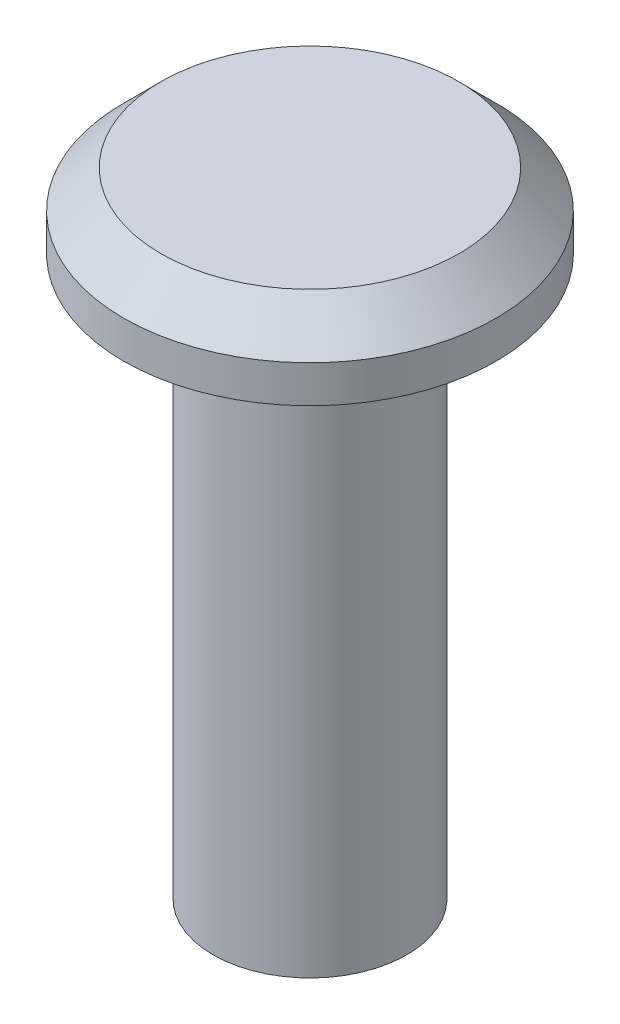
ISO-10303-21;
HEADER;
FILE_DESCRIPTION(('STEP AP214'),'2;1');
FILE_NAME('part.step','',(''),(''),'','','');
FILE_SCHEMA(('AUTOMOTIVE_DESIGN { 1 0 10303 214 1 1 1 1 }'));
ENDSEC;
DATA;
#1=APPLICATION_CONTEXT('core data for automotive mechanical design processes');
#2=APPLICATION_PROTOCOL_DEFINITION('international standard','automotive_design',2000,#1);
#3=PRODUCT_CONTEXT('',#1,'mechanical');
#4=PRODUCT('Part','Part','',(#3));
#5=PRODUCT_RELATED_PRODUCT_CATEGORY('part','',(#4));
#6=PRODUCT_DEFINITION_FORMATION('','',#4);
#7=PRODUCT_DEFINITION_CONTEXT('part definition',#1,'design');
#8=PRODUCT_DEFINITION('design','',#6,#7);
#9=PRODUCT_DEFINITION_SHAPE('','',#8);
#10=(LENGTH_UNIT() NAMED_UNIT(*) SI_UNIT(.MILLI.,.METRE.));
#11=(NAMED_UNIT(*) PLANE_ANGLE_UNIT() SI_UNIT($,.RADIAN.));
#12=(NAMED_UNIT(*) SI_UNIT($,.STERADIAN.) SOLID_ANGLE_UNIT());
#13=UNCERTAINTY_MEASURE_WITH_UNIT(LENGTH_MEASURE(1.E-05),#10,'distance_accuracy_value','');
#14=(GEOMETRIC_REPRESENTATION_CONTEXT(3) GLOBAL_UNCERTAINTY_ASSIGNED_CONTEXT((#13)) GLOBAL_UNIT_ASSIGNED_CONTEXT((#10,
#11,#12)) REPRESENTATION_CONTEXT('',''));
#15=CARTESIAN_POINT('',(0.,0.,0.));
#16=DIRECTION('',(0.,0.,1.));
#17=DIRECTION('',(1.,0.,0.));
#18=AXIS2_PLACEMENT_3D('',#15,#16,#17);
#19=CARTESIAN_POINT('',(0.,15.,0.));
#20=DIRECTION('',(0.,-1.,0.));
#21=DIRECTION('',(0.,0.,-1.));
#22=AXIS2_PLACEMENT_3D('',#19,#20,#21);
#23=CYLINDRICAL_SURFACE('',#22,2.6);
#24=CARTESIAN_POINT('',(0.,13.8,0.));
#25=DIRECTION('',(0.,1.,0.));
#26=DIRECTION('',(0.,0.,1.));
#27=AXIS2_PLACEMENT_3D('',#24,#25,#26);
#28=CIRCLE('',#27,2.6);
#29=CARTESIAN_POINT('',(0.,13.8,2.6));
#30=VERTEX_POINT('',#29);
#31=EDGE_CURVE('E52',#30,#30,#28,.F.);
#32=ORIENTED_EDGE('',*,*,#31,.T.);
#33=EDGE_LOOP('',(#32));
#34=FACE_BOUND('',#33,.T.);
#35=CARTESIAN_POINT('',(0.,0.,0.));
#36=DIRECTION('',(0.,1.,0.));
#37=DIRECTION('',(0.,0.,1.));
#38=AXIS2_PLACEMENT_3D('',#35,#36,#37);
#39=CIRCLE('',#38,2.6);
#40=CARTESIAN_POINT('',(0.,0.,2.6));
#41=VERTEX_POINT('',#40);
#42=EDGE_CURVE('E61',#41,#41,#39,.T.);
#43=ORIENTED_EDGE('',*,*,#42,.T.);
#44=EDGE_LOOP('',(#43));
#45=FACE_BOUND('',#44,.T.);
#46=ADVANCED_FACE('F40',(#34,#45),#23,.T.);
#47=CARTESIAN_POINT('',(0.,0.,0.));
#48=DIRECTION('',(0.,1.,0.));
#49=DIRECTION('',(0.,0.,1.));
#50=AXIS2_PLACEMENT_3D('',#47,#48,#49);
#51=PLANE('',#50);
#52=ORIENTED_EDGE('',*,*,#42,.F.);
#53=EDGE_LOOP('',(#52));
#54=FACE_BOUND('',#53,.T.);
#55=ADVANCED_FACE('F84',(#54),#51,.F.);
#56=CARTESIAN_POINT('',(0.,17.,0.));
#57=DIRECTION('',(0.,-1.,0.));
#58=DIRECTION('',(0.,0.,-1.));
#59=AXIS2_PLACEMENT_3D('',#56,#57,#58);
#60=CYLINDRICAL_SURFACE('',#59,5.);
#61=CARTESIAN_POINT('',(0.,16.,0.));
#62=DIRECTION('',(0.,1.,0.));
#63=DIRECTION('',(0.,0.,1.));
#64=AXIS2_PLACEMENT_3D('',#61,#62,#63);
#65=CIRCLE('',#64,5.);
#66=CARTESIAN_POINT('',(0.,16.,5.));
#67=VERTEX_POINT('',#66);
#68=EDGE_CURVE('E10',#67,#67,#65,.F.);
#69=ORIENTED_EDGE('',*,*,#68,.T.);
#70=EDGE_LOOP('',(#69));
#71=FACE_BOUND('',#70,.T.);
#72=CARTESIAN_POINT('',(0.,15.,0.));
#73=DIRECTION('',(0.,1.,0.));
#74=DIRECTION('',(0.,0.,1.));
#75=AXIS2_PLACEMENT_3D('',#72,#73,#74);
#76=CIRCLE('',#75,5.);
#77=CARTESIAN_POINT('',(0.,15.,5.));
#78=VERTEX_POINT('',#77);
#79=EDGE_CURVE('E64',#78,#78,#76,.T.);
#80=ORIENTED_EDGE('',*,*,#79,.T.);
#81=EDGE_LOOP('',(#80));
#82=FACE_BOUND('',#81,.T.);
#83=ADVANCED_FACE('F68',(#71,#82),#60,.T.);
#84=CARTESIAN_POINT('',(0.,17.,0.));
#85=DIRECTION('',(0.,1.,0.));
#86=DIRECTION('',(0.,0.,1.));
#87=AXIS2_PLACEMENT_3D('',#84,#85,#86);
#88=PLANE('',#87);
#89=CARTESIAN_POINT('',(0.,17.,0.));
#90=DIRECTION('',(0.,1.,0.));
#91=DIRECTION('',(0.,0.,1.));
#92=AXIS2_PLACEMENT_3D('',#89,#90,#91);
#93=CIRCLE('',#92,4.);
#94=CARTESIAN_POINT('',(0.,17.,4.));
#95=VERTEX_POINT('',#94);
#96=EDGE_CURVE('E48',#95,#95,#93,.T.);
#97=ORIENTED_EDGE('',*,*,#96,.T.);
#98=EDGE_LOOP('',(#97));
#99=FACE_BOUND('',#98,.T.);
#100=ADVANCED_FACE('F73',(#99),#88,.T.);
#101=CARTESIAN_POINT('',(0.,15.,0.));
#102=DIRECTION('',(0.,1.,0.));
#103=DIRECTION('',(0.,0.,1.));
#104=AXIS2_PLACEMENT_3D('',#101,#102,#103);
#105=PLANE('',#104);
#106=CARTESIAN_POINT('',(0.,15.,0.));
#107=DIRECTION('',(0.,1.,0.));
#108=DIRECTION('',(0.,0.,1.));
#109=AXIS2_PLACEMENT_3D('',#106,#107,#108);
#110=CIRCLE('',#109,3.80000000000001);
#111=CARTESIAN_POINT('',(0.,15.,3.80000000000001));
#112=VERTEX_POINT('',#111);
#113=EDGE_CURVE('E56',#112,#112,#110,.T.);
#114=ORIENTED_EDGE('',*,*,#113,.T.);
#115=EDGE_LOOP('',(#114));
#116=FACE_BOUND('',#115,.T.);
#117=ORIENTED_EDGE('',*,*,#79,.F.);
#118=EDGE_LOOP('',(#117));
#119=FACE_BOUND('',#118,.T.);
#120=ADVANCED_FACE('F70',(#116,#119),#105,.F.);
#121=CARTESIAN_POINT('',(0.,15.,0.));
#122=DIRECTION('',(0.,1.,0.));
#123=DIRECTION('',(0.,0.,1.));
#124=AXIS2_PLACEMENT_3D('',#121,#122,#123);
#125=CONICAL_SURFACE('',#124,3.80000000000001,0.785398163397453);
#126=ORIENTED_EDGE('',*,*,#31,.F.);
#127=EDGE_LOOP('',(#126));
#128=FACE_BOUND('',#127,.T.);
#129=ORIENTED_EDGE('',*,*,#113,.F.);
#130=EDGE_LOOP('',(#129));
#131=FACE_BOUND('',#130,.T.);
#132=ADVANCED_FACE('F72',(#128,#131),#125,.T.);
#133=CARTESIAN_POINT('',(0.,17.,0.));
#134=DIRECTION('',(0.,-1.,0.));
#135=DIRECTION('',(0.,0.,-1.));
#136=AXIS2_PLACEMENT_3D('',#133,#134,#135);
#137=CONICAL_SURFACE('',#136,4.,0.785398163397446);
#138=ORIENTED_EDGE('',*,*,#68,.F.);
#139=EDGE_LOOP('',(#138));
#140=FACE_BOUND('',#139,.T.);
#141=ORIENTED_EDGE('',*,*,#96,.F.);
#142=EDGE_LOOP('',(#141));
#143=FACE_BOUND('',#142,.T.);
#144=ADVANCED_FACE('F43',(#140,#143),#137,.T.);
#145=CLOSED_SHELL('',(#46,#55,#83,#100,#120,#132,#144));
#146=MANIFOLD_SOLID_BREP('B2',#145);
#147=ADVANCED_BREP_SHAPE_REPRESENTATION('',(#18,#146),#14);
#148=SHAPE_DEFINITION_REPRESENTATION(#9,#147);
ENDSEC;
END-ISO-10303-21;
